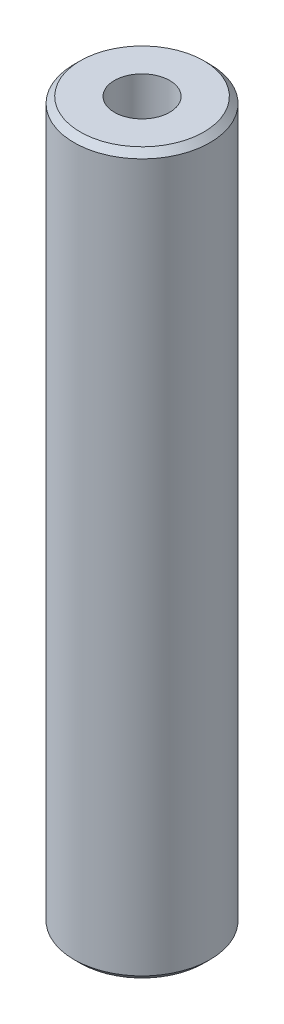
ISO-10303-21;
HEADER;
FILE_DESCRIPTION(('STEP AP214'),'2;1');
FILE_NAME('part.step','',(''),(''),'','','');
FILE_SCHEMA(('AUTOMOTIVE_DESIGN { 1 0 10303 214 1 1 1 1 }'));
ENDSEC;
DATA;
#1=APPLICATION_CONTEXT('core data for automotive mechanical design processes');
#2=APPLICATION_PROTOCOL_DEFINITION('international standard','automotive_design',2000,#1);
#3=PRODUCT_CONTEXT('',#1,'mechanical');
#4=PRODUCT('Part','Part','',(#3));
#5=PRODUCT_RELATED_PRODUCT_CATEGORY('part','',(#4));
#6=PRODUCT_DEFINITION_FORMATION('','',#4);
#7=PRODUCT_DEFINITION_CONTEXT('part definition',#1,'design');
#8=PRODUCT_DEFINITION('design','',#6,#7);
#9=PRODUCT_DEFINITION_SHAPE('','',#8);
#10=(LENGTH_UNIT() NAMED_UNIT(*) SI_UNIT(.MILLI.,.METRE.));
#11=(NAMED_UNIT(*) PLANE_ANGLE_UNIT() SI_UNIT($,.RADIAN.));
#12=(NAMED_UNIT(*) SI_UNIT($,.STERADIAN.) SOLID_ANGLE_UNIT());
#13=UNCERTAINTY_MEASURE_WITH_UNIT(LENGTH_MEASURE(1.E-05),#10,'distance_accuracy_value','');
#14=(GEOMETRIC_REPRESENTATION_CONTEXT(3) GLOBAL_UNCERTAINTY_ASSIGNED_CONTEXT((#13)) GLOBAL_UNIT_ASSIGNED_CONTEXT((#10,
#11,#12)) REPRESENTATION_CONTEXT('',''));
#15=CARTESIAN_POINT('',(0.,0.,0.));
#16=DIRECTION('',(0.,0.,1.));
#17=DIRECTION('',(1.,0.,0.));
#18=AXIS2_PLACEMENT_3D('',#15,#16,#17);
#19=CARTESIAN_POINT('',(0.,582.9457741596,0.));
#20=DIRECTION('',(0.,-1.,0.));
#21=DIRECTION('',(0.,0.,-1.));
#22=AXIS2_PLACEMENT_3D('',#19,#20,#21);
#23=CYLINDRICAL_SURFACE('',#22,55.);
#24=CARTESIAN_POINT('',(0.,577.96825207351,0.));
#25=DIRECTION('',(0.,1.,0.));
#26=DIRECTION('',(0.,0.,1.));
#27=AXIS2_PLACEMENT_3D('',#24,#25,#26);
#28=CIRCLE('',#27,55.);
#29=CARTESIAN_POINT('',(0.,577.96825207351,-55.0000000000001));
#30=VERTEX_POINT('',#29);
#31=EDGE_CURVE('E50',#30,#30,#28,.F.);
#32=ORIENTED_EDGE('',*,*,#31,.T.);
#33=EDGE_LOOP('',(#32));
#34=FACE_BOUND('',#33,.T.);
#35=CARTESIAN_POINT('',(0.,4.97752208609015,0.));
#36=DIRECTION('',(0.,1.,0.));
#37=DIRECTION('',(0.,0.,1.));
#38=AXIS2_PLACEMENT_3D('',#35,#36,#37);
#39=CIRCLE('',#38,55.);
#40=CARTESIAN_POINT('',(0.,4.97752208609015,55.));
#41=VERTEX_POINT('',#40);
#42=EDGE_CURVE('E51',#41,#41,#39,.T.);
#43=ORIENTED_EDGE('',*,*,#42,.T.);
#44=EDGE_LOOP('',(#43));
#45=FACE_BOUND('',#44,.T.);
#46=ADVANCED_FACE('F39',(#34,#45),#23,.T.);
#47=CARTESIAN_POINT('',(0.,582.9457741596,0.));
#48=DIRECTION('',(0.,1.,0.));
#49=DIRECTION('',(0.,0.,1.));
#50=AXIS2_PLACEMENT_3D('',#47,#48,#49);
#51=PLANE('',#50);
#52=CARTESIAN_POINT('',(0.,582.9457741596,0.));
#53=DIRECTION('',(0.,1.,0.));
#54=DIRECTION('',(0.,0.,1.));
#55=AXIS2_PLACEMENT_3D('',#52,#53,#54);
#56=CIRCLE('',#55,50.0224779139098);
#57=CARTESIAN_POINT('',(0.,582.9457741596,-50.0224779139098));
#58=VERTEX_POINT('',#57);
#59=EDGE_CURVE('E54',#58,#58,#56,.T.);
#60=ORIENTED_EDGE('',*,*,#59,.T.);
#61=EDGE_LOOP('',(#60));
#62=FACE_BOUND('',#61,.T.);
#63=CARTESIAN_POINT('',(0.,582.9457741596,0.));
#64=DIRECTION('',(0.,1.,0.));
#65=DIRECTION('',(0.,0.,1.));
#66=AXIS2_PLACEMENT_3D('',#63,#64,#65);
#67=CIRCLE('',#66,22.3731457196306);
#68=CARTESIAN_POINT('',(0.,582.9457741596,22.3731457196306));
#69=VERTEX_POINT('',#68);
#70=EDGE_CURVE('E58',#69,#69,#67,.T.);
#71=ORIENTED_EDGE('',*,*,#70,.F.);
#72=EDGE_LOOP('',(#71));
#73=FACE_BOUND('',#72,.T.);
#74=ADVANCED_FACE('F69',(#62,#73),#51,.T.);
#75=CARTESIAN_POINT('',(0.,0.,0.));
#76=DIRECTION('',(0.,1.,0.));
#77=DIRECTION('',(0.,0.,1.));
#78=AXIS2_PLACEMENT_3D('',#75,#76,#77);
#79=PLANE('',#78);
#80=CARTESIAN_POINT('',(0.,0.,0.));
#81=DIRECTION('',(0.,1.,0.));
#82=DIRECTION('',(0.,0.,1.));
#83=AXIS2_PLACEMENT_3D('',#80,#81,#82);
#84=CIRCLE('',#83,50.0224779139098);
#85=CARTESIAN_POINT('',(0.,0.,50.0224779139098));
#86=VERTEX_POINT('',#85);
#87=EDGE_CURVE('E10',#86,#86,#84,.F.);
#88=ORIENTED_EDGE('',*,*,#87,.T.);
#89=EDGE_LOOP('',(#88));
#90=FACE_BOUND('',#89,.T.);
#91=CARTESIAN_POINT('',(0.,0.,0.));
#92=DIRECTION('',(0.,1.,0.));
#93=DIRECTION('',(0.,0.,1.));
#94=AXIS2_PLACEMENT_3D('',#91,#92,#93);
#95=CIRCLE('',#94,22.3731457196306);
#96=CARTESIAN_POINT('',(0.,0.,22.3731457196306));
#97=VERTEX_POINT('',#96);
#98=EDGE_CURVE('E63',#97,#97,#95,.T.);
#99=ORIENTED_EDGE('',*,*,#98,.T.);
#100=EDGE_LOOP('',(#99));
#101=FACE_BOUND('',#100,.T.);
#102=ADVANCED_FACE('F75',(#90,#101),#79,.F.);
#103=CARTESIAN_POINT('',(0.,582.9457741596,0.));
#104=DIRECTION('',(0.,-1.,0.));
#105=DIRECTION('',(0.,0.,-1.));
#106=AXIS2_PLACEMENT_3D('',#103,#104,#105);
#107=CYLINDRICAL_SURFACE('',#106,22.3731457196306);
#108=ORIENTED_EDGE('',*,*,#70,.T.);
#109=EDGE_LOOP('',(#108));
#110=FACE_BOUND('',#109,.T.);
#111=ORIENTED_EDGE('',*,*,#98,.F.);
#112=EDGE_LOOP('',(#111));
#113=FACE_BOUND('',#112,.T.);
#114=ADVANCED_FACE('F70',(#110,#113),#107,.F.);
#115=CARTESIAN_POINT('',(0.,582.9457741596,0.));
#116=DIRECTION('',(0.,-1.,0.));
#117=DIRECTION('',(0.,0.,-1.));
#118=AXIS2_PLACEMENT_3D('',#115,#116,#117);
#119=CONICAL_SURFACE('',#118,50.0224779139098,0.785398163397443);
#120=CARTESIAN_POINT('',(0.,577.96825207351,-55.0000000000001));
#121=CARTESIAN_POINT('',(0.,578.020101261906,-54.9481508116033));
#122=CARTESIAN_POINT('',(0.,578.071950450303,-54.8963016232065));
#123=CARTESIAN_POINT('',(0.,578.175648827097,-54.792603246413));
#124=CARTESIAN_POINT('',(0.,578.227498015493,-54.7407540580162));
#125=CARTESIAN_POINT('',(0.,578.331196392287,-54.6370556812226));
#126=CARTESIAN_POINT('',(0.,578.383045580684,-54.5852064928259));
#127=CARTESIAN_POINT('',(0.,578.486743957477,-54.4815081160323));
#128=CARTESIAN_POINT('',(0.,578.538593145874,-54.4296589276356));
#129=CARTESIAN_POINT('',(0.,578.642291522668,-54.325960550842));
#130=CARTESIAN_POINT('',(0.,578.694140711064,-54.2741113624452));
#131=CARTESIAN_POINT('',(0.,578.797839087858,-54.1704129856517));
#132=CARTESIAN_POINT('',(0.,578.849688276255,-54.1185637972549));
#133=CARTESIAN_POINT('',(0.,578.953386653048,-54.0148654204614));
#134=CARTESIAN_POINT('',(0.,579.005235841445,-53.9630162320646));
#135=CARTESIAN_POINT('',(0.,579.108934218238,-53.8593178552711));
#136=CARTESIAN_POINT('',(0.,579.160783406635,-53.8074686668743));
#137=CARTESIAN_POINT('',(0.,579.264481783429,-53.7037702900807));
#138=CARTESIAN_POINT('',(0.,579.316330971826,-53.651921101684));
#139=CARTESIAN_POINT('',(0.,579.420029348619,-53.5482227248904));
#140=CARTESIAN_POINT('',(0.,579.471878537016,-53.4963735364936));
#141=CARTESIAN_POINT('',(0.,579.575576913809,-53.3926751597001));
#142=CARTESIAN_POINT('',(0.,579.627426102206,-53.3408259713033));
#143=CARTESIAN_POINT('',(0.,579.731124479,-53.2371275945098));
#144=CARTESIAN_POINT('',(0.,579.782973667397,-53.185278406113));
#145=CARTESIAN_POINT('',(0.,579.88667204419,-53.0815800293195));
#146=CARTESIAN_POINT('',(0.,579.938521232587,-53.0297308409227));
#147=CARTESIAN_POINT('',(0.,580.04221960938,-52.9260324641291));
#148=CARTESIAN_POINT('',(0.,580.094068797777,-52.8741832757324));
#149=CARTESIAN_POINT('',(0.,580.197767174571,-52.7704848989388));
#150=CARTESIAN_POINT('',(0.,580.249616362968,-52.718635710542));
#151=CARTESIAN_POINT('',(0.,580.353314739761,-52.6149373337485));
#152=CARTESIAN_POINT('',(0.,580.405163928158,-52.5630881453517));
#153=CARTESIAN_POINT('',(0.,580.508862304951,-52.4593897685582));
#154=CARTESIAN_POINT('',(0.,580.560711493348,-52.4075405801614));
#155=CARTESIAN_POINT('',(0.,580.664409870142,-52.3038422033679));
#156=CARTESIAN_POINT('',(0.,580.716259058539,-52.2519930149711));
#157=CARTESIAN_POINT('',(0.,580.819957435332,-52.1482946381775));
#158=CARTESIAN_POINT('',(0.,580.871806623729,-52.0964454497808));
#159=CARTESIAN_POINT('',(0.,580.975505000522,-51.9927470729872));
#160=CARTESIAN_POINT('',(0.,581.027354188919,-51.9408978845904));
#161=CARTESIAN_POINT('',(0.,581.131052565713,-51.8371995077969));
#162=CARTESIAN_POINT('',(0.,581.182901754109,-51.7853503194001));
#163=CARTESIAN_POINT('',(0.,581.286600130903,-51.6816519426066));
#164=CARTESIAN_POINT('',(0.,581.3384493193,-51.6298027542098));
#165=CARTESIAN_POINT('',(0.,581.442147696093,-51.5261043774163));
#166=CARTESIAN_POINT('',(0.,581.49399688449,-51.4742551890195));
#167=CARTESIAN_POINT('',(0.,581.597695261284,-51.3705568122259));
#168=CARTESIAN_POINT('',(0.,581.64954444968,-51.3187076238292));
#169=CARTESIAN_POINT('',(0.,581.753242826474,-51.2150092470356));
#170=CARTESIAN_POINT('',(0.,581.805092014871,-51.1631600586389));
#171=CARTESIAN_POINT('',(0.,581.908790391664,-51.0594616818453));
#172=CARTESIAN_POINT('',(0.,581.960639580061,-51.0076124934485));
#173=CARTESIAN_POINT('',(0.,582.064337956855,-50.903914116655));
#174=CARTESIAN_POINT('',(0.,582.116187145251,-50.8520649282582));
#175=CARTESIAN_POINT('',(0.,582.219885522045,-50.7483665514647));
#176=CARTESIAN_POINT('',(0.,582.271734710442,-50.6965173630679));
#177=CARTESIAN_POINT('',(0.,582.375433087235,-50.5928189862744));
#178=CARTESIAN_POINT('',(0.,582.427282275632,-50.5409697978776));
#179=CARTESIAN_POINT('',(0.,582.530980652425,-50.437271421084));
#180=CARTESIAN_POINT('',(0.,582.582829840822,-50.3854222326873));
#181=CARTESIAN_POINT('',(0.,582.686528217616,-50.2817238558937));
#182=CARTESIAN_POINT('',(0.,582.738377406013,-50.2298746674969));
#183=CARTESIAN_POINT('',(0.,582.842075782806,-50.1261762907034));
#184=CARTESIAN_POINT('',(0.,582.893924971203,-50.0743271023066));
#185=CARTESIAN_POINT('',(0.,582.9457741596,-50.0224779139098));
#186=B_SPLINE_CURVE_WITH_KNOTS('',3,(#120,#121,#122,#123,#124,#125,#126,#127,#128,#129,#130,
#131,#132,#133,#134,#135,#136,#137,#138,#139,#140,#141,#142,#143,#144,#145,#146,#147,#148,#149,
#150,#151,#152,#153,#154,#155,#156,#157,#158,#159,#160,#161,#162,#163,#164,#165,#166,#167,#168,
#169,#170,#171,#172,#173,#174,#175,#176,#177,#178,#179,#180,#181,#182,#183,#184,#185),
.UNSPECIFIED.,.F.,.F.,(4,2,2,2,2,2,2,2,2,2,2,2,2,2,2,2,2,2,2,2,2,2,2,2,2,2,2,2,2,2,2,2,4),(0.,
0.21997747628626,0.439954952572524,0.659932428858784,0.879909905145043,1.0998873814313,
1.31986485771757,1.53984233400383,1.75981981029009,1.97979728657635,2.19977476286261,
2.41975223914887,2.63972971543513,2.85970719172139,3.07968466800765,3.29966214429391,
3.51963962058018,3.73961709686644,3.9595945731527,4.17957204943896,4.39954952572522,
4.61952700201148,4.83950447829774,5.059481954584,5.27945943087026,5.49943690715652,
5.71941438344278,5.93939185972905,6.15936933601531,6.37934681230156,6.59932428858782,
6.81930176487409,7.03927924116043),.UNSPECIFIED.);
#187=EDGE_CURVE('BSEAM81',#30,#58,#186,.T.);
#188=ORIENTED_EDGE('',*,*,#31,.F.);
#189=ORIENTED_EDGE('',*,*,#59,.F.);
#190=ORIENTED_EDGE('',*,*,#187,.T.);
#191=ORIENTED_EDGE('',*,*,#187,.F.);
#192=EDGE_LOOP('',(#188,#190,#189,#191));
#193=FACE_BOUND('',#192,.T.);
#194=ADVANCED_FACE('F81',(#193),#119,.T.);
#195=CARTESIAN_POINT('',(0.,4.97752208609015,0.));
#196=DIRECTION('',(0.,1.,0.));
#197=DIRECTION('',(0.,0.,1.));
#198=AXIS2_PLACEMENT_3D('',#195,#196,#197);
#199=CONICAL_SURFACE('',#198,55.,0.785398163397449);
#200=ORIENTED_EDGE('',*,*,#87,.F.);
#201=EDGE_LOOP('',(#200));
#202=FACE_BOUND('',#201,.T.);
#203=ORIENTED_EDGE('',*,*,#42,.F.);
#204=EDGE_LOOP('',(#203));
#205=FACE_BOUND('',#204,.T.);
#206=ADVANCED_FACE('F45',(#202,#205),#199,.T.);
#207=CLOSED_SHELL('',(#46,#74,#102,#114,#194,#206));
#208=MANIFOLD_SOLID_BREP('B2',#207);
#209=ADVANCED_BREP_SHAPE_REPRESENTATION('',(#18,#208),#14);
#210=SHAPE_DEFINITION_REPRESENTATION(#9,#209);
ENDSEC;
END-ISO-10303-21;
